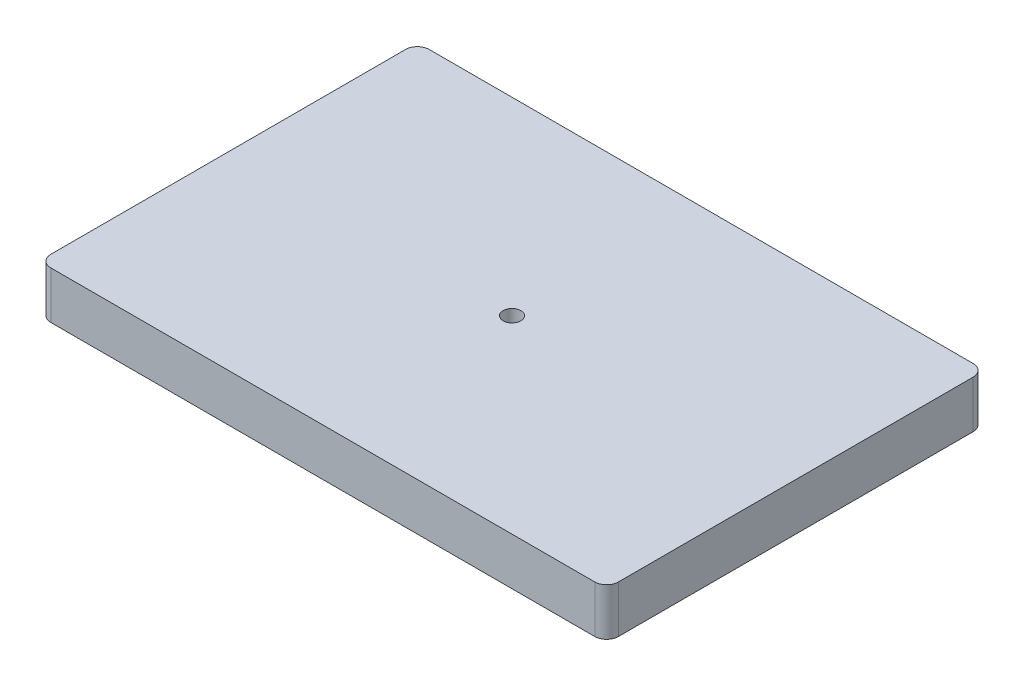
ISO-10303-21;
HEADER;
FILE_DESCRIPTION(('STEP AP214'),'2;1');
FILE_NAME('part.step','',(''),(''),'','','');
FILE_SCHEMA(('AUTOMOTIVE_DESIGN { 1 0 10303 214 1 1 1 1 }'));
ENDSEC;
DATA;
#1=APPLICATION_CONTEXT('core data for automotive mechanical design processes');
#2=APPLICATION_PROTOCOL_DEFINITION('international standard','automotive_design',2000,#1);
#3=PRODUCT_CONTEXT('',#1,'mechanical');
#4=PRODUCT('Part','Part','',(#3));
#5=PRODUCT_RELATED_PRODUCT_CATEGORY('part','',(#4));
#6=PRODUCT_DEFINITION_FORMATION('','',#4);
#7=PRODUCT_DEFINITION_CONTEXT('part definition',#1,'design');
#8=PRODUCT_DEFINITION('design','',#6,#7);
#9=PRODUCT_DEFINITION_SHAPE('','',#8);
#10=(LENGTH_UNIT() NAMED_UNIT(*) SI_UNIT(.MILLI.,.METRE.));
#11=(NAMED_UNIT(*) PLANE_ANGLE_UNIT() SI_UNIT($,.RADIAN.));
#12=(NAMED_UNIT(*) SI_UNIT($,.STERADIAN.) SOLID_ANGLE_UNIT());
#13=UNCERTAINTY_MEASURE_WITH_UNIT(LENGTH_MEASURE(1.E-05),#10,'distance_accuracy_value','');
#14=(GEOMETRIC_REPRESENTATION_CONTEXT(3) GLOBAL_UNCERTAINTY_ASSIGNED_CONTEXT((#13)) GLOBAL_UNIT_ASSIGNED_CONTEXT((#10,
#11,#12)) REPRESENTATION_CONTEXT('',''));
#15=CARTESIAN_POINT('',(0.,0.,0.));
#16=DIRECTION('',(0.,0.,1.));
#17=DIRECTION('',(1.,0.,0.));
#18=AXIS2_PLACEMENT_3D('',#15,#16,#17);
#19=CARTESIAN_POINT('',(-73.025,12.7,47.625));
#20=DIRECTION('',(0.,-1.,0.));
#21=DIRECTION('',(0.,0.,-1.));
#22=AXIS2_PLACEMENT_3D('',#19,#20,#21);
#23=CYLINDRICAL_SURFACE('',#22,3.175);
#24=CARTESIAN_POINT('',(-73.025,0.,47.625));
#25=DIRECTION('',(0.,1.,0.));
#26=DIRECTION('',(0.,0.,-1.));
#27=AXIS2_PLACEMENT_3D('',#24,#25,#26);
#28=CIRCLE('',#27,3.175);
#29=CARTESIAN_POINT('',(-76.2,0.,47.625));
#30=VERTEX_POINT('',#29);
#31=CARTESIAN_POINT('',(-73.025,0.,50.8));
#32=VERTEX_POINT('',#31);
#33=EDGE_CURVE('E129',#30,#32,#28,.T.);
#34=ORIENTED_EDGE('',*,*,#33,.T.);
#35=DIRECTION('',(0.,-1.,0.));
#36=VECTOR('',#35,1.);
#37=CARTESIAN_POINT('',(-73.025,12.7,50.8));
#38=LINE('',#37,#36);
#39=CARTESIAN_POINT('',(-73.025,12.7,50.8));
#40=VERTEX_POINT('',#39);
#41=EDGE_CURVE('E11',#40,#32,#38,.T.);
#42=ORIENTED_EDGE('',*,*,#41,.F.);
#43=CARTESIAN_POINT('',(-73.025,12.7,47.625));
#44=DIRECTION('',(0.,1.,0.));
#45=DIRECTION('',(0.,0.,-1.));
#46=AXIS2_PLACEMENT_3D('',#43,#44,#45);
#47=CIRCLE('',#46,3.175);
#48=CARTESIAN_POINT('',(-76.2,12.7,47.625));
#49=VERTEX_POINT('',#48);
#50=EDGE_CURVE('E144',#49,#40,#47,.T.);
#51=ORIENTED_EDGE('',*,*,#50,.F.);
#52=DIRECTION('',(0.,-1.,0.));
#53=VECTOR('',#52,1.);
#54=CARTESIAN_POINT('',(-76.2,12.7,47.625));
#55=LINE('',#54,#53);
#56=EDGE_CURVE('E125',#49,#30,#55,.T.);
#57=ORIENTED_EDGE('',*,*,#56,.T.);
#58=EDGE_LOOP('',(#34,#42,#51,#57));
#59=FACE_BOUND('',#58,.T.);
#60=ADVANCED_FACE('F33',(#59),#23,.T.);
#61=CARTESIAN_POINT('',(-73.025,12.7,50.8));
#62=DIRECTION('',(0.,0.,-1.));
#63=DIRECTION('',(-1.,0.,0.));
#64=AXIS2_PLACEMENT_3D('',#61,#62,#63);
#65=PLANE('',#64);
#66=DIRECTION('',(1.,0.,0.));
#67=VECTOR('',#66,1.);
#68=CARTESIAN_POINT('',(-73.025,0.,50.8));
#69=LINE('',#68,#67);
#70=CARTESIAN_POINT('',(73.025,0.,50.8));
#71=VERTEX_POINT('',#70);
#72=EDGE_CURVE('E132',#32,#71,#69,.T.);
#73=ORIENTED_EDGE('',*,*,#72,.T.);
#74=DIRECTION('',(0.,-1.,0.));
#75=VECTOR('',#74,1.);
#76=CARTESIAN_POINT('',(73.025,12.7,50.8));
#77=LINE('',#76,#75);
#78=CARTESIAN_POINT('',(73.025,12.7,50.8));
#79=VERTEX_POINT('',#78);
#80=EDGE_CURVE('E41',#79,#71,#77,.T.);
#81=ORIENTED_EDGE('',*,*,#80,.F.);
#82=DIRECTION('',(1.,0.,0.));
#83=VECTOR('',#82,1.);
#84=CARTESIAN_POINT('',(-73.025,12.7,50.8));
#85=LINE('',#84,#83);
#86=EDGE_CURVE('E92',#40,#79,#85,.T.);
#87=ORIENTED_EDGE('',*,*,#86,.F.);
#88=ORIENTED_EDGE('',*,*,#41,.T.);
#89=EDGE_LOOP('',(#73,#81,#87,#88));
#90=FACE_BOUND('',#89,.T.);
#91=ADVANCED_FACE('F198',(#90),#65,.F.);
#92=CARTESIAN_POINT('',(73.025,12.7,47.625));
#93=DIRECTION('',(0.,-1.,0.));
#94=DIRECTION('',(0.,0.,-1.));
#95=AXIS2_PLACEMENT_3D('',#92,#93,#94);
#96=CYLINDRICAL_SURFACE('',#95,3.175);
#97=CARTESIAN_POINT('',(73.025,0.,47.625));
#98=DIRECTION('',(0.,1.,0.));
#99=DIRECTION('',(0.,0.,1.));
#100=AXIS2_PLACEMENT_3D('',#97,#98,#99);
#101=CIRCLE('',#100,3.175);
#102=CARTESIAN_POINT('',(76.2,0.,47.625));
#103=VERTEX_POINT('',#102);
#104=EDGE_CURVE('E135',#71,#103,#101,.T.);
#105=ORIENTED_EDGE('',*,*,#104,.T.);
#106=DIRECTION('',(0.,-1.,0.));
#107=VECTOR('',#106,1.);
#108=CARTESIAN_POINT('',(76.2,12.7,47.625));
#109=LINE('',#108,#107);
#110=CARTESIAN_POINT('',(76.2,12.7,47.625));
#111=VERTEX_POINT('',#110);
#112=EDGE_CURVE('E151',#111,#103,#109,.T.);
#113=ORIENTED_EDGE('',*,*,#112,.F.);
#114=CARTESIAN_POINT('',(73.025,12.7,47.625));
#115=DIRECTION('',(0.,1.,0.));
#116=DIRECTION('',(0.,0.,1.));
#117=AXIS2_PLACEMENT_3D('',#114,#115,#116);
#118=CIRCLE('',#117,3.175);
#119=EDGE_CURVE('E159',#79,#111,#118,.T.);
#120=ORIENTED_EDGE('',*,*,#119,.F.);
#121=ORIENTED_EDGE('',*,*,#80,.T.);
#122=EDGE_LOOP('',(#105,#113,#120,#121));
#123=FACE_BOUND('',#122,.T.);
#124=ADVANCED_FACE('F157',(#123),#96,.T.);
#125=CARTESIAN_POINT('',(76.2,12.7,-47.625));
#126=DIRECTION('',(-1.,0.,0.));
#127=DIRECTION('',(0.,0.,1.));
#128=AXIS2_PLACEMENT_3D('',#125,#126,#127);
#129=PLANE('',#128);
#130=DIRECTION('',(0.,0.,-1.));
#131=VECTOR('',#130,1.);
#132=CARTESIAN_POINT('',(76.2,0.,-47.625));
#133=LINE('',#132,#131);
#134=CARTESIAN_POINT('',(76.2,0.,-47.625));
#135=VERTEX_POINT('',#134);
#136=EDGE_CURVE('E137',#103,#135,#133,.T.);
#137=ORIENTED_EDGE('',*,*,#136,.T.);
#138=DIRECTION('',(0.,-1.,0.));
#139=VECTOR('',#138,1.);
#140=CARTESIAN_POINT('',(76.2,12.7,-47.625));
#141=LINE('',#140,#139);
#142=CARTESIAN_POINT('',(76.2,12.7,-47.625));
#143=VERTEX_POINT('',#142);
#144=EDGE_CURVE('E148',#143,#135,#141,.T.);
#145=ORIENTED_EDGE('',*,*,#144,.F.);
#146=DIRECTION('',(0.,0.,-1.));
#147=VECTOR('',#146,1.);
#148=CARTESIAN_POINT('',(76.2,12.7,-47.625));
#149=LINE('',#148,#147);
#150=EDGE_CURVE('E171',#111,#143,#149,.T.);
#151=ORIENTED_EDGE('',*,*,#150,.F.);
#152=ORIENTED_EDGE('',*,*,#112,.T.);
#153=EDGE_LOOP('',(#137,#145,#151,#152));
#154=FACE_BOUND('',#153,.T.);
#155=ADVANCED_FACE('F167',(#154),#129,.F.);
#156=CARTESIAN_POINT('',(73.025,12.7,-47.625));
#157=DIRECTION('',(0.,-1.,0.));
#158=DIRECTION('',(0.,0.,-1.));
#159=AXIS2_PLACEMENT_3D('',#156,#157,#158);
#160=CYLINDRICAL_SURFACE('',#159,3.175);
#161=CARTESIAN_POINT('',(73.025,0.,-47.625));
#162=DIRECTION('',(0.,1.,0.));
#163=DIRECTION('',(0.,0.,1.));
#164=AXIS2_PLACEMENT_3D('',#161,#162,#163);
#165=CIRCLE('',#164,3.175);
#166=CARTESIAN_POINT('',(73.025,0.,-50.8));
#167=VERTEX_POINT('',#166);
#168=EDGE_CURVE('E139',#135,#167,#165,.T.);
#169=ORIENTED_EDGE('',*,*,#168,.T.);
#170=DIRECTION('',(0.,-1.,0.));
#171=VECTOR('',#170,1.);
#172=CARTESIAN_POINT('',(73.025,12.7,-50.8));
#173=LINE('',#172,#171);
#174=CARTESIAN_POINT('',(73.025,12.7,-50.8));
#175=VERTEX_POINT('',#174);
#176=EDGE_CURVE('E120',#175,#167,#173,.T.);
#177=ORIENTED_EDGE('',*,*,#176,.F.);
#178=CARTESIAN_POINT('',(73.025,12.7,-47.625));
#179=DIRECTION('',(0.,1.,0.));
#180=DIRECTION('',(0.,0.,1.));
#181=AXIS2_PLACEMENT_3D('',#178,#179,#180);
#182=CIRCLE('',#181,3.175);
#183=EDGE_CURVE('E111',#143,#175,#182,.T.);
#184=ORIENTED_EDGE('',*,*,#183,.F.);
#185=ORIENTED_EDGE('',*,*,#144,.T.);
#186=EDGE_LOOP('',(#169,#177,#184,#185));
#187=FACE_BOUND('',#186,.T.);
#188=ADVANCED_FACE('F170',(#187),#160,.T.);
#189=CARTESIAN_POINT('',(-73.025,12.7,-50.8));
#190=DIRECTION('',(0.,0.,1.));
#191=DIRECTION('',(1.,0.,0.));
#192=AXIS2_PLACEMENT_3D('',#189,#190,#191);
#193=PLANE('',#192);
#194=DIRECTION('',(-1.,0.,0.));
#195=VECTOR('',#194,1.);
#196=CARTESIAN_POINT('',(-73.025,0.,-50.8));
#197=LINE('',#196,#195);
#198=CARTESIAN_POINT('',(-73.025,0.,-50.8));
#199=VERTEX_POINT('',#198);
#200=EDGE_CURVE('E119',#167,#199,#197,.T.);
#201=ORIENTED_EDGE('',*,*,#200,.T.);
#202=DIRECTION('',(0.,-1.,0.));
#203=VECTOR('',#202,1.);
#204=CARTESIAN_POINT('',(-73.025,12.7,-50.8));
#205=LINE('',#204,#203);
#206=CARTESIAN_POINT('',(-73.025,12.7,-50.8));
#207=VERTEX_POINT('',#206);
#208=EDGE_CURVE('E116',#207,#199,#205,.T.);
#209=ORIENTED_EDGE('',*,*,#208,.F.);
#210=DIRECTION('',(-1.,0.,0.));
#211=VECTOR('',#210,1.);
#212=CARTESIAN_POINT('',(-73.025,12.7,-50.8));
#213=LINE('',#212,#211);
#214=EDGE_CURVE('E105',#175,#207,#213,.T.);
#215=ORIENTED_EDGE('',*,*,#214,.F.);
#216=ORIENTED_EDGE('',*,*,#176,.T.);
#217=EDGE_LOOP('',(#201,#209,#215,#216));
#218=FACE_BOUND('',#217,.T.);
#219=ADVANCED_FACE('F117',(#218),#193,.F.);
#220=CARTESIAN_POINT('',(-73.025,12.7,-47.625));
#221=DIRECTION('',(0.,-1.,0.));
#222=DIRECTION('',(0.,0.,-1.));
#223=AXIS2_PLACEMENT_3D('',#220,#221,#222);
#224=CYLINDRICAL_SURFACE('',#223,3.175);
#225=CARTESIAN_POINT('',(-73.025,0.,-47.625));
#226=DIRECTION('',(0.,1.,0.));
#227=DIRECTION('',(0.,0.,1.));
#228=AXIS2_PLACEMENT_3D('',#225,#226,#227);
#229=CIRCLE('',#228,3.175);
#230=CARTESIAN_POINT('',(-76.2,0.,-47.625));
#231=VERTEX_POINT('',#230);
#232=EDGE_CURVE('E78',#199,#231,#229,.T.);
#233=ORIENTED_EDGE('',*,*,#232,.T.);
#234=DIRECTION('',(0.,-1.,0.));
#235=VECTOR('',#234,1.);
#236=CARTESIAN_POINT('',(-76.2,12.7,-47.625));
#237=LINE('',#236,#235);
#238=CARTESIAN_POINT('',(-76.2,12.7,-47.625));
#239=VERTEX_POINT('',#238);
#240=EDGE_CURVE('E121',#239,#231,#237,.T.);
#241=ORIENTED_EDGE('',*,*,#240,.F.);
#242=CARTESIAN_POINT('',(-73.025,12.7,-47.625));
#243=DIRECTION('',(0.,1.,0.));
#244=DIRECTION('',(0.,0.,1.));
#245=AXIS2_PLACEMENT_3D('',#242,#243,#244);
#246=CIRCLE('',#245,3.175);
#247=EDGE_CURVE('E109',#207,#239,#246,.T.);
#248=ORIENTED_EDGE('',*,*,#247,.F.);
#249=ORIENTED_EDGE('',*,*,#208,.T.);
#250=EDGE_LOOP('',(#233,#241,#248,#249));
#251=FACE_BOUND('',#250,.T.);
#252=ADVANCED_FACE('F123',(#251),#224,.T.);
#253=CARTESIAN_POINT('',(-76.2,12.7,-47.625));
#254=DIRECTION('',(1.,0.,0.));
#255=DIRECTION('',(0.,0.,-1.));
#256=AXIS2_PLACEMENT_3D('',#253,#254,#255);
#257=PLANE('',#256);
#258=DIRECTION('',(0.,0.,1.));
#259=VECTOR('',#258,1.);
#260=CARTESIAN_POINT('',(-76.2,0.,-47.625));
#261=LINE('',#260,#259);
#262=EDGE_CURVE('E84',#231,#30,#261,.T.);
#263=ORIENTED_EDGE('',*,*,#262,.T.);
#264=ORIENTED_EDGE('',*,*,#56,.F.);
#265=DIRECTION('',(0.,0.,1.));
#266=VECTOR('',#265,1.);
#267=CARTESIAN_POINT('',(-76.2,12.7,-47.625));
#268=LINE('',#267,#266);
#269=EDGE_CURVE('E49',#239,#49,#268,.T.);
#270=ORIENTED_EDGE('',*,*,#269,.F.);
#271=ORIENTED_EDGE('',*,*,#240,.T.);
#272=EDGE_LOOP('',(#263,#264,#270,#271));
#273=FACE_BOUND('',#272,.T.);
#274=ADVANCED_FACE('F193',(#273),#257,.F.);
#275=CARTESIAN_POINT('',(-73.025,12.7,47.625));
#276=DIRECTION('',(0.,-1.,0.));
#277=DIRECTION('',(0.,0.,-1.));
#278=AXIS2_PLACEMENT_3D('',#275,#276,#277);
#279=PLANE('',#278);
#280=CARTESIAN_POINT('',(0.,12.7,0.));
#281=DIRECTION('',(0.,-1.,0.));
#282=DIRECTION('',(0.,0.,-1.));
#283=AXIS2_PLACEMENT_3D('',#280,#281,#282);
#284=CIRCLE('',#283,2.38125);
#285=CARTESIAN_POINT('',(0.,12.7,-2.38125));
#286=VERTEX_POINT('',#285);
#287=EDGE_CURVE('E177',#286,#286,#284,.T.);
#288=ORIENTED_EDGE('',*,*,#287,.T.);
#289=EDGE_LOOP('',(#288));
#290=FACE_BOUND('',#289,.T.);
#291=ORIENTED_EDGE('',*,*,#50,.T.);
#292=ORIENTED_EDGE('',*,*,#86,.T.);
#293=ORIENTED_EDGE('',*,*,#119,.T.);
#294=ORIENTED_EDGE('',*,*,#150,.T.);
#295=ORIENTED_EDGE('',*,*,#183,.T.);
#296=ORIENTED_EDGE('',*,*,#214,.T.);
#297=ORIENTED_EDGE('',*,*,#247,.T.);
#298=ORIENTED_EDGE('',*,*,#269,.T.);
#299=EDGE_LOOP('',(#291,#292,#293,#294,#295,#296,#297,#298));
#300=FACE_BOUND('',#299,.T.);
#301=ADVANCED_FACE('F107',(#290,#300),#279,.F.);
#302=CARTESIAN_POINT('',(-73.025,0.,47.625));
#303=DIRECTION('',(0.,-1.,0.));
#304=DIRECTION('',(0.,0.,-1.));
#305=AXIS2_PLACEMENT_3D('',#302,#303,#304);
#306=PLANE('',#305);
#307=CARTESIAN_POINT('',(0.,0.,0.));
#308=DIRECTION('',(0.,-1.,0.));
#309=DIRECTION('',(0.,0.,-1.));
#310=AXIS2_PLACEMENT_3D('',#307,#308,#309);
#311=CIRCLE('',#310,2.38125);
#312=CARTESIAN_POINT('',(0.,0.,-2.38125));
#313=VERTEX_POINT('',#312);
#314=EDGE_CURVE('E133',#313,#313,#311,.T.);
#315=ORIENTED_EDGE('',*,*,#314,.F.);
#316=EDGE_LOOP('',(#315));
#317=FACE_BOUND('',#316,.T.);
#318=ORIENTED_EDGE('',*,*,#33,.F.);
#319=ORIENTED_EDGE('',*,*,#262,.F.);
#320=ORIENTED_EDGE('',*,*,#232,.F.);
#321=ORIENTED_EDGE('',*,*,#200,.F.);
#322=ORIENTED_EDGE('',*,*,#168,.F.);
#323=ORIENTED_EDGE('',*,*,#136,.F.);
#324=ORIENTED_EDGE('',*,*,#104,.F.);
#325=ORIENTED_EDGE('',*,*,#72,.F.);
#326=EDGE_LOOP('',(#318,#319,#320,#321,#322,#323,#324,#325));
#327=FACE_BOUND('',#326,.T.);
#328=ADVANCED_FACE('F163',(#317,#327),#306,.T.);
#329=CARTESIAN_POINT('',(0.,0.,0.));
#330=DIRECTION('',(0.,1.,0.));
#331=DIRECTION('',(0.,0.,1.));
#332=AXIS2_PLACEMENT_3D('',#329,#330,#331);
#333=CYLINDRICAL_SURFACE('',#332,2.38125);
#334=ORIENTED_EDGE('',*,*,#314,.T.);
#335=EDGE_LOOP('',(#334));
#336=FACE_BOUND('',#335,.T.);
#337=ORIENTED_EDGE('',*,*,#287,.F.);
#338=EDGE_LOOP('',(#337));
#339=FACE_BOUND('',#338,.T.);
#340=ADVANCED_FACE('F183',(#336,#339),#333,.F.);
#341=CLOSED_SHELL('',(#60,#91,#124,#155,#188,#219,#252,#274,#301,#328,#340));
#342=MANIFOLD_SOLID_BREP('B2',#341);
#343=ADVANCED_BREP_SHAPE_REPRESENTATION('',(#18,#342),#14);
#344=SHAPE_DEFINITION_REPRESENTATION(#9,#343);
ENDSEC;
END-ISO-10303-21;
